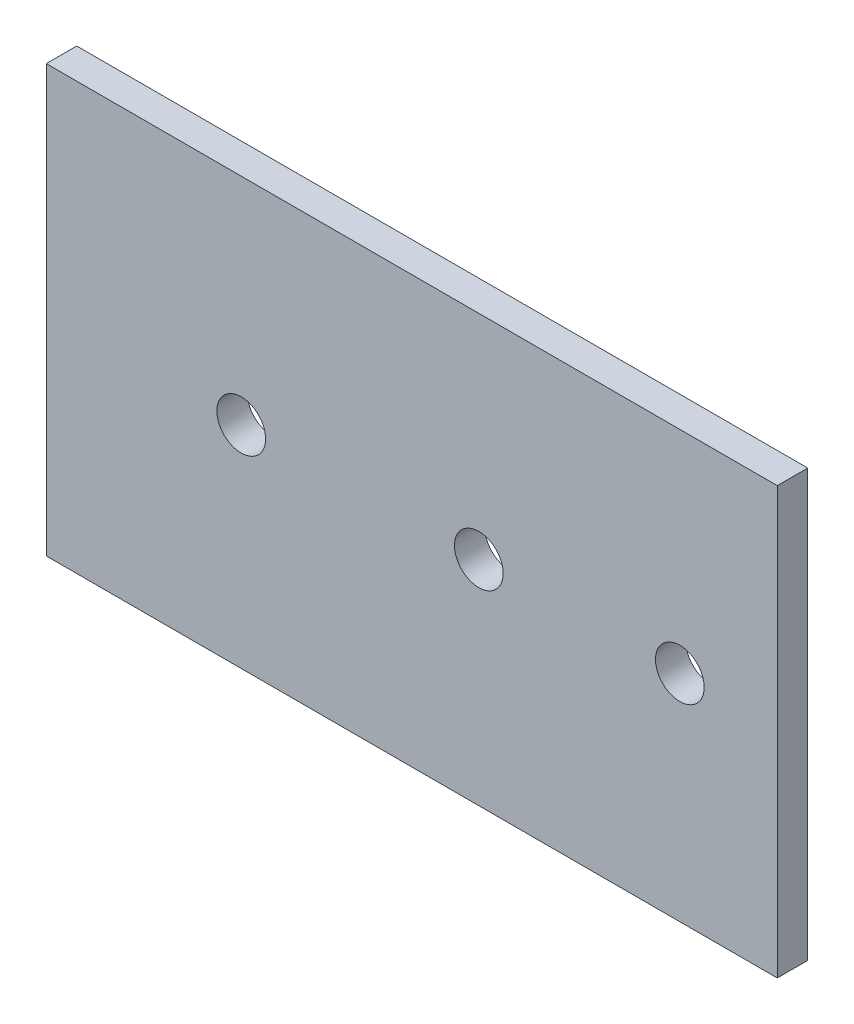
ISO-10303-21;
HEADER;
FILE_DESCRIPTION(('STEP AP214'),'2;1');
FILE_NAME('part.step','',(''),(''),'','','');
FILE_SCHEMA(('AUTOMOTIVE_DESIGN { 1 0 10303 214 1 1 1 1 }'));
ENDSEC;
DATA;
#1=APPLICATION_CONTEXT('core data for automotive mechanical design processes');
#2=APPLICATION_PROTOCOL_DEFINITION('international standard','automotive_design',2000,#1);
#3=PRODUCT_CONTEXT('',#1,'mechanical');
#4=PRODUCT('Part','Part','',(#3));
#5=PRODUCT_RELATED_PRODUCT_CATEGORY('part','',(#4));
#6=PRODUCT_DEFINITION_FORMATION('','',#4);
#7=PRODUCT_DEFINITION_CONTEXT('part definition',#1,'design');
#8=PRODUCT_DEFINITION('design','',#6,#7);
#9=PRODUCT_DEFINITION_SHAPE('','',#8);
#10=(LENGTH_UNIT() NAMED_UNIT(*) SI_UNIT(.MILLI.,.METRE.));
#11=(NAMED_UNIT(*) PLANE_ANGLE_UNIT() SI_UNIT($,.RADIAN.));
#12=(NAMED_UNIT(*) SI_UNIT($,.STERADIAN.) SOLID_ANGLE_UNIT());
#13=UNCERTAINTY_MEASURE_WITH_UNIT(LENGTH_MEASURE(1.E-05),#10,'distance_accuracy_value','');
#14=(GEOMETRIC_REPRESENTATION_CONTEXT(3) GLOBAL_UNCERTAINTY_ASSIGNED_CONTEXT((#13)) GLOBAL_UNIT_ASSIGNED_CONTEXT((#10,
#11,#12)) REPRESENTATION_CONTEXT('',''));
#15=CARTESIAN_POINT('',(0.,0.,0.));
#16=DIRECTION('',(0.,0.,1.));
#17=DIRECTION('',(1.,0.,0.));
#18=AXIS2_PLACEMENT_3D('',#15,#16,#17);
#19=CARTESIAN_POINT('',(-75.,35.,2.5));
#20=DIRECTION('',(0.,-1.,0.));
#21=DIRECTION('',(0.,0.,-1.));
#22=AXIS2_PLACEMENT_3D('',#19,#20,#21);
#23=PLANE('',#22);
#24=DIRECTION('',(-1.,0.,0.));
#25=VECTOR('',#24,1.);
#26=CARTESIAN_POINT('',(-75.,35.,2.5));
#27=LINE('',#26,#25);
#28=CARTESIAN_POINT('',(45.,35.,2.5));
#29=VERTEX_POINT('',#28);
#30=CARTESIAN_POINT('',(-75.,35.,2.5));
#31=VERTEX_POINT('',#30);
#32=EDGE_CURVE('E96',#29,#31,#27,.T.);
#33=ORIENTED_EDGE('',*,*,#32,.F.);
#34=DIRECTION('',(0.,0.,1.));
#35=VECTOR('',#34,1.);
#36=CARTESIAN_POINT('',(45.,35.,-2.5));
#37=LINE('',#36,#35);
#38=CARTESIAN_POINT('',(45.,35.,-2.5));
#39=VERTEX_POINT('',#38);
#40=EDGE_CURVE('E121',#39,#29,#37,.T.);
#41=ORIENTED_EDGE('',*,*,#40,.F.);
#42=DIRECTION('',(-1.,0.,0.));
#43=VECTOR('',#42,1.);
#44=CARTESIAN_POINT('',(-75.,35.,-2.5));
#45=LINE('',#44,#43);
#46=CARTESIAN_POINT('',(-75.,35.,-2.5));
#47=VERTEX_POINT('',#46);
#48=EDGE_CURVE('E87',#39,#47,#45,.T.);
#49=ORIENTED_EDGE('',*,*,#48,.T.);
#50=DIRECTION('',(0.,0.,-1.));
#51=VECTOR('',#50,1.);
#52=CARTESIAN_POINT('',(-75.,35.,2.5));
#53=LINE('',#52,#51);
#54=EDGE_CURVE('E11',#31,#47,#53,.T.);
#55=ORIENTED_EDGE('',*,*,#54,.F.);
#56=EDGE_LOOP('',(#33,#41,#49,#55));
#57=FACE_BOUND('',#56,.T.);
#58=ADVANCED_FACE('F43',(#57),#23,.F.);
#59=CARTESIAN_POINT('',(-75.,-35.,2.5));
#60=DIRECTION('',(1.,0.,0.));
#61=DIRECTION('',(0.,0.,-1.));
#62=AXIS2_PLACEMENT_3D('',#59,#60,#61);
#63=PLANE('',#62);
#64=DIRECTION('',(0.,-1.,0.));
#65=VECTOR('',#64,1.);
#66=CARTESIAN_POINT('',(-75.,-35.,-2.5));
#67=LINE('',#66,#65);
#68=CARTESIAN_POINT('',(-75.,-35.,-2.5));
#69=VERTEX_POINT('',#68);
#70=EDGE_CURVE('E78',#47,#69,#67,.T.);
#71=ORIENTED_EDGE('',*,*,#70,.T.);
#72=DIRECTION('',(0.,0.,-1.));
#73=VECTOR('',#72,1.);
#74=CARTESIAN_POINT('',(-75.,-35.,2.5));
#75=LINE('',#74,#73);
#76=CARTESIAN_POINT('',(-75.,-35.,2.5));
#77=VERTEX_POINT('',#76);
#78=EDGE_CURVE('E50',#77,#69,#75,.T.);
#79=ORIENTED_EDGE('',*,*,#78,.F.);
#80=DIRECTION('',(0.,-1.,0.));
#81=VECTOR('',#80,1.);
#82=CARTESIAN_POINT('',(-75.,-35.,2.5));
#83=LINE('',#82,#81);
#84=EDGE_CURVE('E66',#31,#77,#83,.T.);
#85=ORIENTED_EDGE('',*,*,#84,.F.);
#86=ORIENTED_EDGE('',*,*,#54,.T.);
#87=EDGE_LOOP('',(#71,#79,#85,#86));
#88=FACE_BOUND('',#87,.T.);
#89=ADVANCED_FACE('F80',(#88),#63,.F.);
#90=CARTESIAN_POINT('',(-75.,-35.,2.5));
#91=DIRECTION('',(0.,1.,0.));
#92=DIRECTION('',(0.,0.,1.));
#93=AXIS2_PLACEMENT_3D('',#90,#91,#92);
#94=PLANE('',#93);
#95=DIRECTION('',(1.,0.,0.));
#96=VECTOR('',#95,1.);
#97=CARTESIAN_POINT('',(-75.,-35.,-2.5));
#98=LINE('',#97,#96);
#99=CARTESIAN_POINT('',(45.,-35.,-2.5));
#100=VERTEX_POINT('',#99);
#101=EDGE_CURVE('E86',#69,#100,#98,.T.);
#102=ORIENTED_EDGE('',*,*,#101,.T.);
#103=DIRECTION('',(0.,0.,1.));
#104=VECTOR('',#103,1.);
#105=CARTESIAN_POINT('',(45.,-35.,-2.5));
#106=LINE('',#105,#104);
#107=CARTESIAN_POINT('',(45.,-35.,2.5));
#108=VERTEX_POINT('',#107);
#109=EDGE_CURVE('E57',#100,#108,#106,.T.);
#110=ORIENTED_EDGE('',*,*,#109,.T.);
#111=DIRECTION('',(1.,0.,0.));
#112=VECTOR('',#111,1.);
#113=CARTESIAN_POINT('',(-75.,-35.,2.5));
#114=LINE('',#113,#112);
#115=EDGE_CURVE('E92',#77,#108,#114,.T.);
#116=ORIENTED_EDGE('',*,*,#115,.F.);
#117=ORIENTED_EDGE('',*,*,#78,.T.);
#118=EDGE_LOOP('',(#102,#110,#116,#117));
#119=FACE_BOUND('',#118,.T.);
#120=ADVANCED_FACE('F91',(#119),#94,.F.);
#121=CARTESIAN_POINT('',(0.,0.,2.5));
#122=DIRECTION('',(0.,0.,-1.));
#123=DIRECTION('',(-1.,0.,0.));
#124=AXIS2_PLACEMENT_3D('',#121,#122,#123);
#125=PLANE('',#124);
#126=CARTESIAN_POINT('',(-3.99705161979855,0.,2.5));
#127=DIRECTION('',(0.,0.,1.));
#128=DIRECTION('',(1.,0.,0.));
#129=AXIS2_PLACEMENT_3D('',#126,#127,#128);
#130=CIRCLE('',#129,4.);
#131=CARTESIAN_POINT('',(0.0029483802014476,0.,2.5));
#132=VERTEX_POINT('',#131);
#133=EDGE_CURVE('E108',#132,#132,#130,.T.);
#134=ORIENTED_EDGE('',*,*,#133,.F.);
#135=EDGE_LOOP('',(#134));
#136=FACE_BOUND('',#135,.T.);
#137=CARTESIAN_POINT('',(-42.9953353984873,-0.365871995189486,2.5));
#138=DIRECTION('',(0.,0.,1.));
#139=DIRECTION('',(1.,0.,0.));
#140=AXIS2_PLACEMENT_3D('',#137,#138,#139);
#141=CIRCLE('',#140,4.);
#142=CARTESIAN_POINT('',(-38.9953353984873,-0.365871995189486,2.5));
#143=VERTEX_POINT('',#142);
#144=EDGE_CURVE('E107',#143,#143,#141,.T.);
#145=ORIENTED_EDGE('',*,*,#144,.F.);
#146=EDGE_LOOP('',(#145));
#147=FACE_BOUND('',#146,.T.);
#148=CARTESIAN_POINT('',(29.0014961929381,0.309583995929586,2.5));
#149=DIRECTION('',(0.,0.,1.));
#150=DIRECTION('',(1.,0.,0.));
#151=AXIS2_PLACEMENT_3D('',#148,#149,#150);
#152=CIRCLE('',#151,4.00000000000001);
#153=CARTESIAN_POINT('',(33.0014961929381,0.309583995929586,2.5));
#154=VERTEX_POINT('',#153);
#155=EDGE_CURVE('E101',#154,#154,#152,.T.);
#156=ORIENTED_EDGE('',*,*,#155,.F.);
#157=EDGE_LOOP('',(#156));
#158=FACE_BOUND('',#157,.T.);
#159=ORIENTED_EDGE('',*,*,#115,.T.);
#160=DIRECTION('',(0.,-1.,0.));
#161=VECTOR('',#160,1.);
#162=CARTESIAN_POINT('',(45.,-35.,2.5));
#163=LINE('',#162,#161);
#164=EDGE_CURVE('E125',#29,#108,#163,.T.);
#165=ORIENTED_EDGE('',*,*,#164,.F.);
#166=ORIENTED_EDGE('',*,*,#32,.T.);
#167=ORIENTED_EDGE('',*,*,#84,.T.);
#168=EDGE_LOOP('',(#159,#165,#166,#167));
#169=FACE_BOUND('',#168,.T.);
#170=ADVANCED_FACE('F133',(#136,#147,#158,#169),#125,.F.);
#171=CARTESIAN_POINT('',(0.,0.,-2.5));
#172=DIRECTION('',(0.,0.,-1.));
#173=DIRECTION('',(-1.,0.,0.));
#174=AXIS2_PLACEMENT_3D('',#171,#172,#173);
#175=PLANE('',#174);
#176=DIRECTION('',(0.,-1.,0.));
#177=VECTOR('',#176,1.);
#178=CARTESIAN_POINT('',(45.,-35.,-2.5));
#179=LINE('',#178,#177);
#180=EDGE_CURVE('E95',#39,#100,#179,.T.);
#181=ORIENTED_EDGE('',*,*,#180,.T.);
#182=ORIENTED_EDGE('',*,*,#101,.F.);
#183=ORIENTED_EDGE('',*,*,#70,.F.);
#184=ORIENTED_EDGE('',*,*,#48,.F.);
#185=EDGE_LOOP('',(#181,#182,#183,#184));
#186=FACE_BOUND('',#185,.T.);
#187=CARTESIAN_POINT('',(-3.99705161979855,0.,-2.5));
#188=DIRECTION('',(0.,0.,1.));
#189=DIRECTION('',(1.,0.,0.));
#190=AXIS2_PLACEMENT_3D('',#187,#188,#189);
#191=CIRCLE('',#190,4.);
#192=CARTESIAN_POINT('',(0.0029483802014476,0.,-2.5));
#193=VERTEX_POINT('',#192);
#194=EDGE_CURVE('E116',#193,#193,#191,.T.);
#195=ORIENTED_EDGE('',*,*,#194,.T.);
#196=EDGE_LOOP('',(#195));
#197=FACE_BOUND('',#196,.T.);
#198=CARTESIAN_POINT('',(-42.9953353984873,-0.365871995189486,-2.5));
#199=DIRECTION('',(0.,0.,1.));
#200=DIRECTION('',(1.,0.,0.));
#201=AXIS2_PLACEMENT_3D('',#198,#199,#200);
#202=CIRCLE('',#201,4.);
#203=CARTESIAN_POINT('',(-38.9953353984873,-0.365871995189486,-2.5));
#204=VERTEX_POINT('',#203);
#205=EDGE_CURVE('E104',#204,#204,#202,.T.);
#206=ORIENTED_EDGE('',*,*,#205,.T.);
#207=EDGE_LOOP('',(#206));
#208=FACE_BOUND('',#207,.T.);
#209=CARTESIAN_POINT('',(29.0014961929381,0.309583995929586,-2.5));
#210=DIRECTION('',(0.,0.,1.));
#211=DIRECTION('',(1.,0.,0.));
#212=AXIS2_PLACEMENT_3D('',#209,#210,#211);
#213=CIRCLE('',#212,4.00000000000001);
#214=CARTESIAN_POINT('',(33.0014961929381,0.309583995929586,-2.5));
#215=VERTEX_POINT('',#214);
#216=EDGE_CURVE('E111',#215,#215,#213,.T.);
#217=ORIENTED_EDGE('',*,*,#216,.T.);
#218=EDGE_LOOP('',(#217));
#219=FACE_BOUND('',#218,.T.);
#220=ADVANCED_FACE('F93',(#186,#197,#208,#219),#175,.T.);
#221=CARTESIAN_POINT('',(29.0014961929381,0.309583995929586,-2.5));
#222=DIRECTION('',(0.,0.,1.));
#223=DIRECTION('',(1.,0.,0.));
#224=AXIS2_PLACEMENT_3D('',#221,#222,#223);
#225=CYLINDRICAL_SURFACE('',#224,4.00000000000001);
#226=ORIENTED_EDGE('',*,*,#216,.F.);
#227=EDGE_LOOP('',(#226));
#228=FACE_BOUND('',#227,.T.);
#229=ORIENTED_EDGE('',*,*,#155,.T.);
#230=EDGE_LOOP('',(#229));
#231=FACE_BOUND('',#230,.T.);
#232=ADVANCED_FACE('F141',(#228,#231),#225,.F.);
#233=CARTESIAN_POINT('',(-42.9953353984873,-0.365871995189486,-2.5));
#234=DIRECTION('',(0.,0.,1.));
#235=DIRECTION('',(1.,0.,0.));
#236=AXIS2_PLACEMENT_3D('',#233,#234,#235);
#237=CYLINDRICAL_SURFACE('',#236,4.);
#238=ORIENTED_EDGE('',*,*,#205,.F.);
#239=EDGE_LOOP('',(#238));
#240=FACE_BOUND('',#239,.T.);
#241=ORIENTED_EDGE('',*,*,#144,.T.);
#242=EDGE_LOOP('',(#241));
#243=FACE_BOUND('',#242,.T.);
#244=ADVANCED_FACE('F186',(#240,#243),#237,.F.);
#245=CARTESIAN_POINT('',(-3.99705161979855,0.,-2.5));
#246=DIRECTION('',(0.,0.,1.));
#247=DIRECTION('',(1.,0.,0.));
#248=AXIS2_PLACEMENT_3D('',#245,#246,#247);
#249=CYLINDRICAL_SURFACE('',#248,4.);
#250=ORIENTED_EDGE('',*,*,#194,.F.);
#251=EDGE_LOOP('',(#250));
#252=FACE_BOUND('',#251,.T.);
#253=ORIENTED_EDGE('',*,*,#133,.T.);
#254=EDGE_LOOP('',(#253));
#255=FACE_BOUND('',#254,.T.);
#256=ADVANCED_FACE('F193',(#252,#255),#249,.F.);
#257=CARTESIAN_POINT('',(45.,-35.,-2.5));
#258=DIRECTION('',(-1.,0.,0.));
#259=DIRECTION('',(0.,0.,1.));
#260=AXIS2_PLACEMENT_3D('',#257,#258,#259);
#261=PLANE('',#260);
#262=ORIENTED_EDGE('',*,*,#164,.T.);
#263=ORIENTED_EDGE('',*,*,#109,.F.);
#264=ORIENTED_EDGE('',*,*,#180,.F.);
#265=ORIENTED_EDGE('',*,*,#40,.T.);
#266=EDGE_LOOP('',(#262,#263,#264,#265));
#267=FACE_BOUND('',#266,.T.);
#268=ADVANCED_FACE('F129',(#267),#261,.F.);
#269=CLOSED_SHELL('',(#58,#89,#120,#170,#220,#232,#244,#256,#268));
#270=MANIFOLD_SOLID_BREP('B2',#269);
#271=ADVANCED_BREP_SHAPE_REPRESENTATION('',(#18,#270),#14);
#272=SHAPE_DEFINITION_REPRESENTATION(#9,#271);
ENDSEC;
END-ISO-10303-21;
